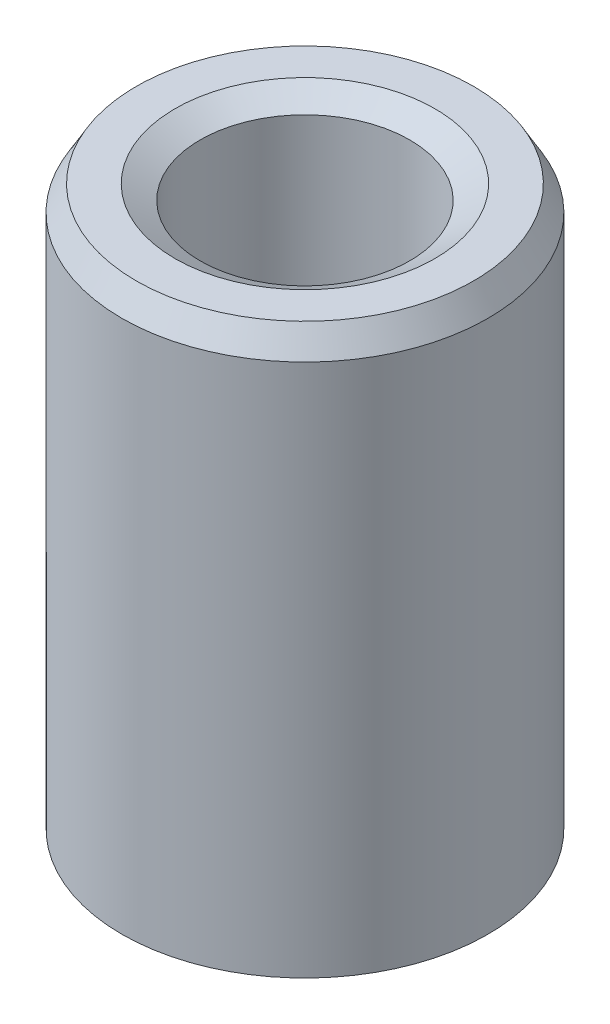
ISO-10303-21;
HEADER;
FILE_DESCRIPTION(('STEP AP214'),'2;1');
FILE_NAME('part.step','',(''),(''),'','','');
FILE_SCHEMA(('AUTOMOTIVE_DESIGN { 1 0 10303 214 1 1 1 1 }'));
ENDSEC;
DATA;
#1=APPLICATION_CONTEXT('core data for automotive mechanical design processes');
#2=APPLICATION_PROTOCOL_DEFINITION('international standard','automotive_design',2000,#1);
#3=PRODUCT_CONTEXT('',#1,'mechanical');
#4=PRODUCT('Part','Part','',(#3));
#5=PRODUCT_RELATED_PRODUCT_CATEGORY('part','',(#4));
#6=PRODUCT_DEFINITION_FORMATION('','',#4);
#7=PRODUCT_DEFINITION_CONTEXT('part definition',#1,'design');
#8=PRODUCT_DEFINITION('design','',#6,#7);
#9=PRODUCT_DEFINITION_SHAPE('','',#8);
#10=(LENGTH_UNIT() NAMED_UNIT(*) SI_UNIT(.MILLI.,.METRE.));
#11=(NAMED_UNIT(*) PLANE_ANGLE_UNIT() SI_UNIT($,.RADIAN.));
#12=(NAMED_UNIT(*) SI_UNIT($,.STERADIAN.) SOLID_ANGLE_UNIT());
#13=UNCERTAINTY_MEASURE_WITH_UNIT(LENGTH_MEASURE(1.E-05),#10,'distance_accuracy_value','');
#14=(GEOMETRIC_REPRESENTATION_CONTEXT(3) GLOBAL_UNCERTAINTY_ASSIGNED_CONTEXT((#13)) GLOBAL_UNIT_ASSIGNED_CONTEXT((#10,
#11,#12)) REPRESENTATION_CONTEXT('',''));
#15=CARTESIAN_POINT('',(0.,0.,0.));
#16=DIRECTION('',(0.,0.,1.));
#17=DIRECTION('',(1.,0.,0.));
#18=AXIS2_PLACEMENT_3D('',#15,#16,#17);
#19=CARTESIAN_POINT('',(0.,31.2961269687243,0.));
#20=DIRECTION('',(0.,-1.,0.));
#21=DIRECTION('',(0.,0.,-1.));
#22=AXIS2_PLACEMENT_3D('',#19,#20,#21);
#23=CYLINDRICAL_SURFACE('',#22,10.);
#24=CARTESIAN_POINT('',(0.,0.791150694183899,0.));
#25=DIRECTION('',(0.,1.,0.));
#26=DIRECTION('',(0.,0.,1.));
#27=AXIS2_PLACEMENT_3D('',#24,#25,#26);
#28=CIRCLE('',#27,10.);
#29=CARTESIAN_POINT('',(0.,0.791150694183899,10.));
#30=VERTEX_POINT('',#29);
#31=EDGE_CURVE('E10',#30,#30,#28,.T.);
#32=ORIENTED_EDGE('',*,*,#31,.T.);
#33=EDGE_LOOP('',(#32));
#34=FACE_BOUND('',#33,.T.);
#35=CARTESIAN_POINT('',(0.,29.9258137699544,0.));
#36=DIRECTION('',(0.,1.,0.));
#37=DIRECTION('',(0.,0.,1.));
#38=AXIS2_PLACEMENT_3D('',#35,#36,#37);
#39=CIRCLE('',#38,10.);
#40=CARTESIAN_POINT('',(0.,29.9258137699544,10.));
#41=VERTEX_POINT('',#40);
#42=EDGE_CURVE('E50',#41,#41,#39,.F.);
#43=ORIENTED_EDGE('',*,*,#42,.T.);
#44=EDGE_LOOP('',(#43));
#45=FACE_BOUND('',#44,.T.);
#46=ADVANCED_FACE('F39',(#34,#45),#23,.T.);
#47=CARTESIAN_POINT('',(0.,31.2961269687243,0.));
#48=DIRECTION('',(0.,1.,0.));
#49=DIRECTION('',(0.,0.,1.));
#50=AXIS2_PLACEMENT_3D('',#47,#48,#49);
#51=PLANE('',#50);
#52=CARTESIAN_POINT('',(0.,31.2961269687243,0.));
#53=DIRECTION('',(0.,1.,0.));
#54=DIRECTION('',(0.,0.,1.));
#55=AXIS2_PLACEMENT_3D('',#52,#53,#54);
#56=CIRCLE('',#55,7.09558426027223);
#57=CARTESIAN_POINT('',(0.,31.2961269687243,7.09558426027223));
#58=VERTEX_POINT('',#57);
#59=EDGE_CURVE('E58',#58,#58,#56,.F.);
#60=ORIENTED_EDGE('',*,*,#59,.T.);
#61=EDGE_LOOP('',(#60));
#62=FACE_BOUND('',#61,.T.);
#63=CARTESIAN_POINT('',(0.,31.2961269687243,0.));
#64=DIRECTION('',(0.,1.,0.));
#65=DIRECTION('',(0.,0.,1.));
#66=AXIS2_PLACEMENT_3D('',#63,#64,#65);
#67=CIRCLE('',#66,9.20884930581611);
#68=CARTESIAN_POINT('',(0.,31.2961269687243,9.20884930581611));
#69=VERTEX_POINT('',#68);
#70=EDGE_CURVE('E61',#69,#69,#67,.T.);
#71=ORIENTED_EDGE('',*,*,#70,.T.);
#72=EDGE_LOOP('',(#71));
#73=FACE_BOUND('',#72,.T.);
#74=ADVANCED_FACE('F88',(#62,#73),#51,.T.);
#75=CARTESIAN_POINT('',(0.,0.,0.));
#76=DIRECTION('',(0.,1.,0.));
#77=DIRECTION('',(0.,0.,1.));
#78=AXIS2_PLACEMENT_3D('',#75,#76,#77);
#79=PLANE('',#78);
#80=CARTESIAN_POINT('',(0.,0.,0.));
#81=DIRECTION('',(0.,1.,0.));
#82=DIRECTION('',(0.,0.,1.));
#83=AXIS2_PLACEMENT_3D('',#80,#81,#82);
#84=CIRCLE('',#83,6.5164217556862);
#85=CARTESIAN_POINT('',(0.,0.,-6.5164217556862));
#86=VERTEX_POINT('',#85);
#87=EDGE_CURVE('E51',#86,#86,#84,.T.);
#88=ORIENTED_EDGE('',*,*,#87,.T.);
#89=EDGE_LOOP('',(#88));
#90=FACE_BOUND('',#89,.T.);
#91=CARTESIAN_POINT('',(0.,0.,0.));
#92=DIRECTION('',(0.,1.,0.));
#93=DIRECTION('',(0.,0.,1.));
#94=AXIS2_PLACEMENT_3D('',#91,#92,#93);
#95=CIRCLE('',#94,8.62968680123009);
#96=CARTESIAN_POINT('',(0.,0.,8.62968680123009));
#97=VERTEX_POINT('',#96);
#98=EDGE_CURVE('E54',#97,#97,#95,.F.);
#99=ORIENTED_EDGE('',*,*,#98,.T.);
#100=EDGE_LOOP('',(#99));
#101=FACE_BOUND('',#100,.T.);
#102=ADVANCED_FACE('F83',(#90,#101),#79,.F.);
#103=CARTESIAN_POINT('',(0.,31.2961269687243,0.));
#104=DIRECTION('',(0.,-1.,0.));
#105=DIRECTION('',(0.,0.,-1.));
#106=AXIS2_PLACEMENT_3D('',#103,#104,#105);
#107=CYLINDRICAL_SURFACE('',#106,5.72527106150229);
#108=CARTESIAN_POINT('',(0.,30.5049762745404,0.));
#109=DIRECTION('',(0.,1.,0.));
#110=DIRECTION('',(0.,0.,1.));
#111=AXIS2_PLACEMENT_3D('',#108,#109,#110);
#112=CIRCLE('',#111,5.72527106150229);
#113=CARTESIAN_POINT('',(0.,30.5049762745404,5.72527106150229));
#114=VERTEX_POINT('',#113);
#115=EDGE_CURVE('E67',#114,#114,#112,.T.);
#116=ORIENTED_EDGE('',*,*,#115,.T.);
#117=EDGE_LOOP('',(#116));
#118=FACE_BOUND('',#117,.T.);
#119=CARTESIAN_POINT('',(0.,1.37031319876992,0.));
#120=DIRECTION('',(0.,1.,0.));
#121=DIRECTION('',(0.,0.,1.));
#122=AXIS2_PLACEMENT_3D('',#119,#120,#121);
#123=CIRCLE('',#122,5.72527106150229);
#124=CARTESIAN_POINT('',(0.,1.37031319876992,-5.72527106150229));
#125=VERTEX_POINT('',#124);
#126=EDGE_CURVE('E69',#125,#125,#123,.F.);
#127=ORIENTED_EDGE('',*,*,#126,.T.);
#128=EDGE_LOOP('',(#127));
#129=FACE_BOUND('',#128,.T.);
#130=ADVANCED_FACE('F71',(#118,#129),#107,.F.);
#131=CARTESIAN_POINT('',(0.,30.5049762745404,0.));
#132=DIRECTION('',(0.,1.,0.));
#133=DIRECTION('',(0.,0.,1.));
#134=AXIS2_PLACEMENT_3D('',#131,#132,#133);
#135=CONICAL_SURFACE('',#134,5.72527106150229,1.0471975511966);
#136=ORIENTED_EDGE('',*,*,#59,.F.);
#137=EDGE_LOOP('',(#136));
#138=FACE_BOUND('',#137,.T.);
#139=ORIENTED_EDGE('',*,*,#115,.F.);
#140=EDGE_LOOP('',(#139));
#141=FACE_BOUND('',#140,.T.);
#142=ADVANCED_FACE('F77',(#138,#141),#135,.F.);
#143=CARTESIAN_POINT('',(0.,0.,0.));
#144=DIRECTION('',(0.,-1.,0.));
#145=DIRECTION('',(0.,0.,-1.));
#146=AXIS2_PLACEMENT_3D('',#143,#144,#145);
#147=CONICAL_SURFACE('',#146,6.5164217556862,0.523598775598295);
#148=CARTESIAN_POINT('',(0.,1.37031319876992,-5.72527106150229));
#149=CARTESIAN_POINT('',(0.,1.3560391029494,-5.73351221456671));
#150=CARTESIAN_POINT('',(0.,1.34176500712888,-5.74175336763113));
#151=CARTESIAN_POINT('',(0.,1.31321681548784,-5.75823567375996));
#152=CARTESIAN_POINT('',(0.,1.29894271966732,-5.76647682682437));
#153=CARTESIAN_POINT('',(0.,1.27039452802628,-5.7829591329532));
#154=CARTESIAN_POINT('',(0.,1.25612043220576,-5.79120028601762));
#155=CARTESIAN_POINT('',(0.,1.22757224056472,-5.80768259214645));
#156=CARTESIAN_POINT('',(0.,1.2132981447442,-5.81592374521087));
#157=CARTESIAN_POINT('',(0.,1.18474995310316,-5.8324060513397));
#158=CARTESIAN_POINT('',(0.,1.17047585728264,-5.84064720440411));
#159=CARTESIAN_POINT('',(0.,1.1419276656416,-5.85712951053294));
#160=CARTESIAN_POINT('',(0.,1.12765356982108,-5.86537066359736));
#161=CARTESIAN_POINT('',(0.,1.09910537818004,-5.88185296972619));
#162=CARTESIAN_POINT('',(0.,1.08483128235952,-5.89009412279061));
#163=CARTESIAN_POINT('',(0.,1.05628309071848,-5.90657642891944));
#164=CARTESIAN_POINT('',(0.,1.04200899489796,-5.91481758198385));
#165=CARTESIAN_POINT('',(0.,1.01346080325692,-5.93129988811268));
#166=CARTESIAN_POINT('',(0.,0.999186707436396,-5.9395410411771));
#167=CARTESIAN_POINT('',(0.,0.970638515795356,-5.95602334730593));
#168=CARTESIAN_POINT('',(0.,0.956364419974836,-5.96426450037035));
#169=CARTESIAN_POINT('',(0.,0.927816228333797,-5.98074680649918));
#170=CARTESIAN_POINT('',(0.,0.913542132513277,-5.98898795956359));
#171=CARTESIAN_POINT('',(0.,0.884993940872237,-6.00547026569243));
#172=CARTESIAN_POINT('',(0.,0.870719845051717,-6.01371141875684));
#173=CARTESIAN_POINT('',(0.,0.842171653410677,-6.03019372488567));
#174=CARTESIAN_POINT('',(0.,0.827897557590157,-6.03843487795009));
#175=CARTESIAN_POINT('',(0.,0.799349365949117,-6.05491718407892));
#176=CARTESIAN_POINT('',(0.,0.785075270128597,-6.06315833714334));
#177=CARTESIAN_POINT('',(0.,0.756527078487557,-6.07964064327217));
#178=CARTESIAN_POINT('',(0.,0.742252982667037,-6.08788179633658));
#179=CARTESIAN_POINT('',(0.,0.713704791025997,-6.10436410246541));
#180=CARTESIAN_POINT('',(0.,0.699430695205477,-6.11260525552983));
#181=CARTESIAN_POINT('',(0.,0.670882503564437,-6.12908756165866));
#182=CARTESIAN_POINT('',(0.,0.656608407743918,-6.13732871472308));
#183=CARTESIAN_POINT('',(0.,0.628060216102878,-6.15381102085191));
#184=CARTESIAN_POINT('',(0.,0.613786120282358,-6.16205217391632));
#185=CARTESIAN_POINT('',(0.,0.585237928641318,-6.17853448004515));
#186=CARTESIAN_POINT('',(0.,0.570963832820798,-6.18677563310957));
#187=CARTESIAN_POINT('',(0.,0.542415641179758,-6.2032579392384));
#188=CARTESIAN_POINT('',(0.,0.528141545359238,-6.21149909230282));
#189=CARTESIAN_POINT('',(0.,0.499593353718198,-6.22798139843165));
#190=CARTESIAN_POINT('',(0.,0.485319257897678,-6.23622255149606));
#191=CARTESIAN_POINT('',(0.,0.456771066256638,-6.2527048576249));
#192=CARTESIAN_POINT('',(0.,0.442496970436118,-6.26094601068931));
#193=CARTESIAN_POINT('',(0.,0.413948778795078,-6.27742831681814));
#194=CARTESIAN_POINT('',(0.,0.399674682974558,-6.28566946988256));
#195=CARTESIAN_POINT('',(0.,0.371126491333519,-6.30215177601139));
#196=CARTESIAN_POINT('',(0.,0.356852395512999,-6.3103929290758));
#197=CARTESIAN_POINT('',(0.,0.328304203871959,-6.32687523520464));
#198=CARTESIAN_POINT('',(0.,0.314030108051439,-6.33511638826905));
#199=CARTESIAN_POINT('',(0.,0.285481916410399,-6.35159869439788));
#200=CARTESIAN_POINT('',(0.,0.271207820589879,-6.3598398474623));
#201=CARTESIAN_POINT('',(0.,0.242659628948839,-6.37632215359113));
#202=CARTESIAN_POINT('',(0.,0.228385533128319,-6.38456330665555));
#203=CARTESIAN_POINT('',(0.,0.199837341487279,-6.40104561278438));
#204=CARTESIAN_POINT('',(0.,0.185563245666759,-6.40928676584879));
#205=CARTESIAN_POINT('',(0.,0.157015054025719,-6.42576907197762));
#206=CARTESIAN_POINT('',(0.,0.142740958205199,-6.43401022504204));
#207=CARTESIAN_POINT('',(0.,0.11419276656416,-6.45049253117087));
#208=CARTESIAN_POINT('',(0.,0.0999186707436397,-6.45873368423529));
#209=CARTESIAN_POINT('',(0.,0.0713704791025998,-6.47521599036412));
#210=CARTESIAN_POINT('',(0.,0.0570963832820798,-6.48345714342853));
#211=CARTESIAN_POINT('',(0.,0.0285481916410399,-6.49993944955736));
#212=CARTESIAN_POINT('',(0.,0.0142740958205199,-6.50818060262178));
#213=CARTESIAN_POINT('',(0.,0.,-6.5164217556862));
#214=B_SPLINE_CURVE_WITH_KNOTS('',3,(#148,#149,#150,#151,#152,#153,#154,#155,#156,#157,#158,
#159,#160,#161,#162,#163,#164,#165,#166,#167,#168,#169,#170,#171,#172,#173,#174,#175,#176,#177,
#178,#179,#180,#181,#182,#183,#184,#185,#186,#187,#188,#189,#190,#191,#192,#193,#194,#195,#196,
#197,#198,#199,#200,#201,#202,#203,#204,#205,#206,#207,#208,#209,#210,#211,#212,#213),
.UNSPECIFIED.,.F.,.F.,(4,2,2,2,2,2,2,2,2,2,2,2,2,2,2,2,2,2,2,2,2,2,2,2,2,2,2,2,2,2,2,2,4),(0.,
0.049446918386494,0.0988938367729881,0.148340755159483,0.197787673545977,0.247234591932471,
0.296681510318965,0.346128428705459,0.395575347091953,0.445022265478447,0.494469183864941,
0.543916102251435,0.59336302063793,0.642809939024424,0.692256857410918,0.741703775797412,
0.791150694183906,0.8405976125704,0.890044530956894,0.939491449343388,0.988938367729882,
1.03838528611638,1.08783220450287,1.13727912288936,1.18672604127586,1.23617295966235,
1.28561987804885,1.33506679643534,1.38451371482184,1.43396063320833,1.48340755159482,
1.53285446998132,1.58230138836781),.UNSPECIFIED.);
#215=EDGE_CURVE('BSEAM73',#125,#86,#214,.T.);
#216=ORIENTED_EDGE('',*,*,#126,.F.);
#217=ORIENTED_EDGE('',*,*,#87,.F.);
#218=ORIENTED_EDGE('',*,*,#215,.T.);
#219=ORIENTED_EDGE('',*,*,#215,.F.);
#220=EDGE_LOOP('',(#216,#218,#217,#219));
#221=FACE_BOUND('',#220,.T.);
#222=ADVANCED_FACE('F73',(#221),#147,.F.);
#223=CARTESIAN_POINT('',(0.,0.791150694183899,0.));
#224=DIRECTION('',(0.,1.,0.));
#225=DIRECTION('',(0.,0.,1.));
#226=AXIS2_PLACEMENT_3D('',#223,#224,#225);
#227=CONICAL_SURFACE('',#226,10.,1.0471975511966);
#228=ORIENTED_EDGE('',*,*,#98,.F.);
#229=EDGE_LOOP('',(#228));
#230=FACE_BOUND('',#229,.T.);
#231=ORIENTED_EDGE('',*,*,#31,.F.);
#232=EDGE_LOOP('',(#231));
#233=FACE_BOUND('',#232,.T.);
#234=ADVANCED_FACE('F76',(#230,#233),#227,.T.);
#235=CARTESIAN_POINT('',(0.,31.2961269687243,0.));
#236=DIRECTION('',(0.,-1.,0.));
#237=DIRECTION('',(0.,0.,-1.));
#238=AXIS2_PLACEMENT_3D('',#235,#236,#237);
#239=CONICAL_SURFACE('',#238,9.20884930581611,0.523598775598295);
#240=ORIENTED_EDGE('',*,*,#42,.F.);
#241=EDGE_LOOP('',(#240));
#242=FACE_BOUND('',#241,.T.);
#243=ORIENTED_EDGE('',*,*,#70,.F.);
#244=EDGE_LOOP('',(#243));
#245=FACE_BOUND('',#244,.T.);
#246=ADVANCED_FACE('F45',(#242,#245),#239,.T.);
#247=CLOSED_SHELL('',(#46,#74,#102,#130,#142,#222,#234,#246));
#248=MANIFOLD_SOLID_BREP('B2',#247);
#249=ADVANCED_BREP_SHAPE_REPRESENTATION('',(#18,#248),#14);
#250=SHAPE_DEFINITION_REPRESENTATION(#9,#249);
ENDSEC;
END-ISO-10303-21;
